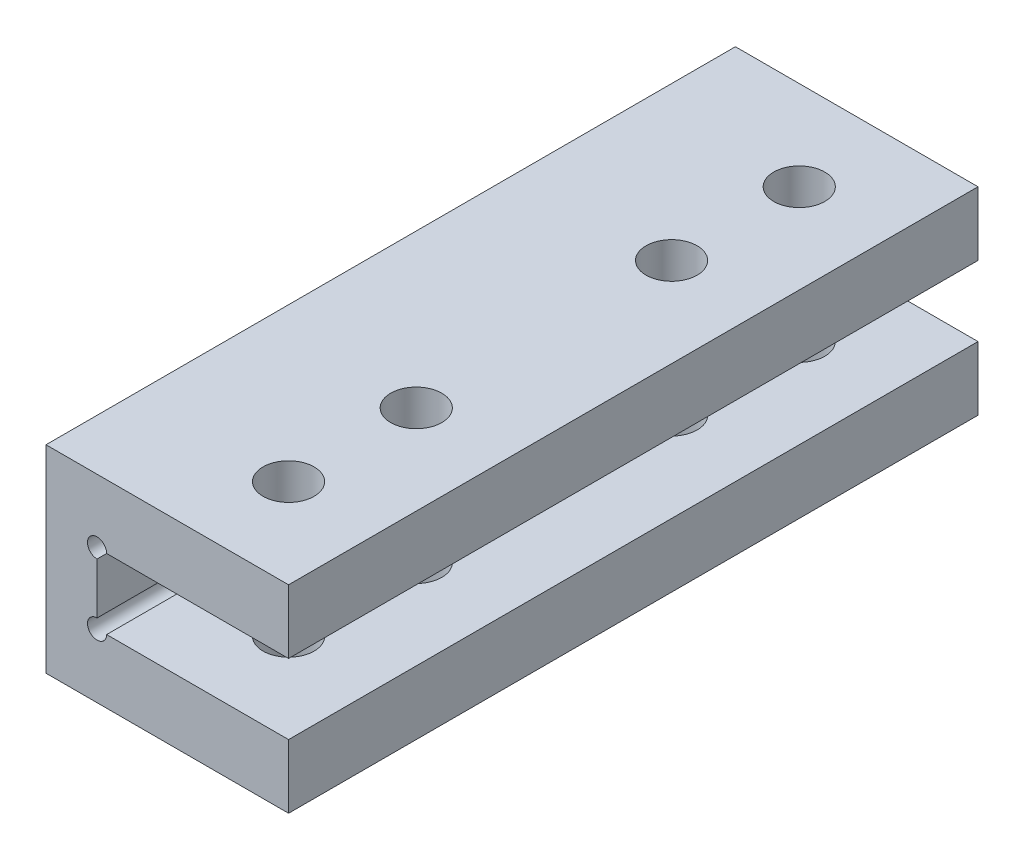
ISO-10303-21;
HEADER;
FILE_DESCRIPTION(('STEP AP214'),'2;1');
FILE_NAME('part.step','',(''),(''),'','','');
FILE_SCHEMA(('AUTOMOTIVE_DESIGN { 1 0 10303 214 1 1 1 1 }'));
ENDSEC;
DATA;
#1=APPLICATION_CONTEXT('core data for automotive mechanical design processes');
#2=APPLICATION_PROTOCOL_DEFINITION('international standard','automotive_design',2000,#1);
#3=PRODUCT_CONTEXT('',#1,'mechanical');
#4=PRODUCT('Part','Part','',(#3));
#5=PRODUCT_RELATED_PRODUCT_CATEGORY('part','',(#4));
#6=PRODUCT_DEFINITION_FORMATION('','',#4);
#7=PRODUCT_DEFINITION_CONTEXT('part definition',#1,'design');
#8=PRODUCT_DEFINITION('design','',#6,#7);
#9=PRODUCT_DEFINITION_SHAPE('','',#8);
#10=(LENGTH_UNIT() NAMED_UNIT(*) SI_UNIT(.MILLI.,.METRE.));
#11=(NAMED_UNIT(*) PLANE_ANGLE_UNIT() SI_UNIT($,.RADIAN.));
#12=(NAMED_UNIT(*) SI_UNIT($,.STERADIAN.) SOLID_ANGLE_UNIT());
#13=UNCERTAINTY_MEASURE_WITH_UNIT(LENGTH_MEASURE(1.E-05),#10,'distance_accuracy_value','');
#14=(GEOMETRIC_REPRESENTATION_CONTEXT(3) GLOBAL_UNCERTAINTY_ASSIGNED_CONTEXT((#13)) GLOBAL_UNIT_ASSIGNED_CONTEXT((#10,
#11,#12)) REPRESENTATION_CONTEXT('',''));
#15=CARTESIAN_POINT('',(0.,0.,0.));
#16=DIRECTION('',(0.,0.,1.));
#17=DIRECTION('',(1.,0.,0.));
#18=AXIS2_PLACEMENT_3D('',#15,#16,#17);
#19=CARTESIAN_POINT('',(0.,5.,0.));
#20=DIRECTION('',(0.,-1.,0.));
#21=DIRECTION('',(0.,0.,-1.));
#22=AXIS2_PLACEMENT_3D('',#19,#20,#21);
#23=PLANE('',#22);
#24=DIRECTION('',(-1.,0.,0.));
#25=VECTOR('',#24,1.);
#26=CARTESIAN_POINT('',(0.,5.,-27.));
#27=LINE('',#26,#25);
#28=CARTESIAN_POINT('',(15.,5.,-27.));
#29=VERTEX_POINT('',#28);
#30=CARTESIAN_POINT('',(-4.,5.,-27.));
#31=VERTEX_POINT('',#30);
#32=EDGE_CURVE('E167',#29,#31,#27,.T.);
#33=ORIENTED_EDGE('',*,*,#32,.T.);
#34=DIRECTION('',(0.,0.,1.));
#35=VECTOR('',#34,1.);
#36=CARTESIAN_POINT('',(-4.,5.,-38.2361025271221));
#37=LINE('',#36,#35);
#38=CARTESIAN_POINT('',(-4.,5.,27.));
#39=VERTEX_POINT('',#38);
#40=EDGE_CURVE('E147',#31,#39,#37,.T.);
#41=ORIENTED_EDGE('',*,*,#40,.T.);
#42=DIRECTION('',(-1.,0.,0.));
#43=VECTOR('',#42,1.);
#44=CARTESIAN_POINT('',(0.,5.,27.));
#45=LINE('',#44,#43);
#46=CARTESIAN_POINT('',(15.,5.,27.));
#47=VERTEX_POINT('',#46);
#48=EDGE_CURVE('E227',#47,#39,#45,.T.);
#49=ORIENTED_EDGE('',*,*,#48,.F.);
#50=DIRECTION('',(0.,0.,-1.));
#51=VECTOR('',#50,1.);
#52=CARTESIAN_POINT('',(15.,5.,0.));
#53=LINE('',#52,#51);
#54=EDGE_CURVE('E165',#47,#29,#53,.T.);
#55=ORIENTED_EDGE('',*,*,#54,.T.);
#56=EDGE_LOOP('',(#33,#41,#49,#55));
#57=FACE_BOUND('',#56,.T.);
#58=CARTESIAN_POINT('',(8.,5.,-10.));
#59=DIRECTION('',(0.,1.,0.));
#60=DIRECTION('',(0.,0.,1.));
#61=AXIS2_PLACEMENT_3D('',#58,#59,#60);
#62=CIRCLE('',#61,2.);
#63=CARTESIAN_POINT('',(8.,5.,-8.));
#64=VERTEX_POINT('',#63);
#65=EDGE_CURVE('E159',#64,#64,#62,.T.);
#66=ORIENTED_EDGE('',*,*,#65,.F.);
#67=EDGE_LOOP('',(#66));
#68=FACE_BOUND('',#67,.T.);
#69=CARTESIAN_POINT('',(8.,5.,-20.));
#70=DIRECTION('',(0.,1.,0.));
#71=DIRECTION('',(0.,0.,1.));
#72=AXIS2_PLACEMENT_3D('',#69,#70,#71);
#73=CIRCLE('',#72,2.);
#74=CARTESIAN_POINT('',(8.,5.,-18.));
#75=VERTEX_POINT('',#74);
#76=EDGE_CURVE('E153',#75,#75,#73,.T.);
#77=ORIENTED_EDGE('',*,*,#76,.F.);
#78=EDGE_LOOP('',(#77));
#79=FACE_BOUND('',#78,.T.);
#80=CARTESIAN_POINT('',(8.,5.,10.));
#81=DIRECTION('',(0.,-1.,0.));
#82=DIRECTION('',(0.,0.,-1.));
#83=AXIS2_PLACEMENT_3D('',#80,#81,#82);
#84=CIRCLE('',#83,2.);
#85=CARTESIAN_POINT('',(8.,5.,8.));
#86=VERTEX_POINT('',#85);
#87=EDGE_CURVE('E222',#86,#86,#84,.T.);
#88=ORIENTED_EDGE('',*,*,#87,.T.);
#89=EDGE_LOOP('',(#88));
#90=FACE_BOUND('',#89,.T.);
#91=CARTESIAN_POINT('',(8.,5.,20.));
#92=DIRECTION('',(0.,-1.,0.));
#93=DIRECTION('',(0.,0.,-1.));
#94=AXIS2_PLACEMENT_3D('',#91,#92,#93);
#95=CIRCLE('',#94,2.);
#96=CARTESIAN_POINT('',(8.,5.,18.));
#97=VERTEX_POINT('',#96);
#98=EDGE_CURVE('E216',#97,#97,#95,.T.);
#99=ORIENTED_EDGE('',*,*,#98,.T.);
#100=EDGE_LOOP('',(#99));
#101=FACE_BOUND('',#100,.T.);
#102=ADVANCED_FACE('F37',(#57,#68,#79,#90,#101),#23,.F.);
#103=CARTESIAN_POINT('',(0.,0.,0.));
#104=DIRECTION('',(0.,-1.,0.));
#105=DIRECTION('',(0.,0.,-1.));
#106=AXIS2_PLACEMENT_3D('',#103,#104,#105);
#107=PLANE('',#106);
#108=DIRECTION('',(0.,0.,1.));
#109=VECTOR('',#108,1.);
#110=CARTESIAN_POINT('',(0.75,0.,-29.1213203435596));
#111=LINE('',#110,#109);
#112=CARTESIAN_POINT('',(0.75,0.,-27.));
#113=VERTEX_POINT('',#112);
#114=CARTESIAN_POINT('',(0.75,0.,27.));
#115=VERTEX_POINT('',#114);
#116=EDGE_CURVE('E59',#113,#115,#111,.T.);
#117=ORIENTED_EDGE('',*,*,#116,.F.);
#118=DIRECTION('',(-1.,0.,0.));
#119=VECTOR('',#118,1.);
#120=CARTESIAN_POINT('',(0.,0.,-27.));
#121=LINE('',#120,#119);
#122=CARTESIAN_POINT('',(15.,0.,-27.));
#123=VERTEX_POINT('',#122);
#124=EDGE_CURVE('E168',#123,#113,#121,.T.);
#125=ORIENTED_EDGE('',*,*,#124,.F.);
#126=DIRECTION('',(0.,0.,-1.));
#127=VECTOR('',#126,1.);
#128=CARTESIAN_POINT('',(15.,0.,0.));
#129=LINE('',#128,#127);
#130=CARTESIAN_POINT('',(15.,0.,27.));
#131=VERTEX_POINT('',#130);
#132=EDGE_CURVE('E162',#131,#123,#129,.T.);
#133=ORIENTED_EDGE('',*,*,#132,.F.);
#134=DIRECTION('',(-1.,0.,0.));
#135=VECTOR('',#134,1.);
#136=CARTESIAN_POINT('',(0.,0.,27.));
#137=LINE('',#136,#135);
#138=EDGE_CURVE('E183',#131,#115,#137,.T.);
#139=ORIENTED_EDGE('',*,*,#138,.T.);
#140=EDGE_LOOP('',(#117,#125,#133,#139));
#141=FACE_BOUND('',#140,.T.);
#142=CARTESIAN_POINT('',(8.,0.,-10.));
#143=DIRECTION('',(0.,1.,0.));
#144=DIRECTION('',(0.,0.,1.));
#145=AXIS2_PLACEMENT_3D('',#142,#143,#144);
#146=CIRCLE('',#145,2.);
#147=CARTESIAN_POINT('',(8.,0.,-8.));
#148=VERTEX_POINT('',#147);
#149=EDGE_CURVE('E156',#148,#148,#146,.T.);
#150=ORIENTED_EDGE('',*,*,#149,.T.);
#151=EDGE_LOOP('',(#150));
#152=FACE_BOUND('',#151,.T.);
#153=CARTESIAN_POINT('',(8.,0.,-20.));
#154=DIRECTION('',(0.,1.,0.));
#155=DIRECTION('',(0.,0.,1.));
#156=AXIS2_PLACEMENT_3D('',#153,#154,#155);
#157=CIRCLE('',#156,2.);
#158=CARTESIAN_POINT('',(8.,0.,-18.));
#159=VERTEX_POINT('',#158);
#160=EDGE_CURVE('E151',#159,#159,#157,.T.);
#161=ORIENTED_EDGE('',*,*,#160,.T.);
#162=EDGE_LOOP('',(#161));
#163=FACE_BOUND('',#162,.T.);
#164=CARTESIAN_POINT('',(8.,0.,10.));
#165=DIRECTION('',(0.,-1.,0.));
#166=DIRECTION('',(0.,0.,-1.));
#167=AXIS2_PLACEMENT_3D('',#164,#165,#166);
#168=CIRCLE('',#167,2.);
#169=CARTESIAN_POINT('',(8.,0.,8.));
#170=VERTEX_POINT('',#169);
#171=EDGE_CURVE('E219',#170,#170,#168,.T.);
#172=ORIENTED_EDGE('',*,*,#171,.F.);
#173=EDGE_LOOP('',(#172));
#174=FACE_BOUND('',#173,.T.);
#175=CARTESIAN_POINT('',(8.,0.,20.));
#176=DIRECTION('',(0.,-1.,0.));
#177=DIRECTION('',(0.,0.,-1.));
#178=AXIS2_PLACEMENT_3D('',#175,#176,#177);
#179=CIRCLE('',#178,2.);
#180=CARTESIAN_POINT('',(8.,0.,18.));
#181=VERTEX_POINT('',#180);
#182=EDGE_CURVE('E215',#181,#181,#179,.T.);
#183=ORIENTED_EDGE('',*,*,#182,.F.);
#184=EDGE_LOOP('',(#183));
#185=FACE_BOUND('',#184,.T.);
#186=ADVANCED_FACE('F178',(#141,#152,#163,#174,#185),#107,.T.);
#187=CARTESIAN_POINT('',(15.,5.,0.));
#188=DIRECTION('',(-1.,0.,0.));
#189=DIRECTION('',(0.,0.,1.));
#190=AXIS2_PLACEMENT_3D('',#187,#188,#189);
#191=PLANE('',#190);
#192=ORIENTED_EDGE('',*,*,#132,.T.);
#193=DIRECTION('',(0.,-1.,0.));
#194=VECTOR('',#193,1.);
#195=CARTESIAN_POINT('',(15.,5.,-27.));
#196=LINE('',#195,#194);
#197=EDGE_CURVE('E45',#29,#123,#196,.T.);
#198=ORIENTED_EDGE('',*,*,#197,.F.);
#199=ORIENTED_EDGE('',*,*,#54,.F.);
#200=DIRECTION('',(0.,-1.,0.));
#201=VECTOR('',#200,1.);
#202=CARTESIAN_POINT('',(15.,5.,27.));
#203=LINE('',#202,#201);
#204=EDGE_CURVE('E230',#47,#131,#203,.T.);
#205=ORIENTED_EDGE('',*,*,#204,.T.);
#206=EDGE_LOOP('',(#192,#198,#199,#205));
#207=FACE_BOUND('',#206,.T.);
#208=ADVANCED_FACE('F39',(#207),#191,.F.);
#209=CARTESIAN_POINT('',(0.,5.,-27.));
#210=DIRECTION('',(0.,0.,1.));
#211=DIRECTION('',(1.,0.,0.));
#212=AXIS2_PLACEMENT_3D('',#209,#210,#211);
#213=PLANE('',#212);
#214=ORIENTED_EDGE('',*,*,#124,.T.);
#215=CARTESIAN_POINT('',(0.,0.,-27.));
#216=DIRECTION('',(0.,0.,1.));
#217=DIRECTION('',(1.,0.,0.));
#218=AXIS2_PLACEMENT_3D('',#215,#216,#217);
#219=CIRCLE('',#218,0.75);
#220=CARTESIAN_POINT('',(0.,-0.75,-27.));
#221=VERTEX_POINT('',#220);
#222=EDGE_CURVE('E119',#221,#113,#219,.F.);
#223=ORIENTED_EDGE('',*,*,#222,.F.);
#224=DIRECTION('',(0.,-1.,0.));
#225=VECTOR('',#224,1.);
#226=CARTESIAN_POINT('',(0.,5.,-27.));
#227=LINE('',#226,#225);
#228=CARTESIAN_POINT('',(0.,-4.75,-27.));
#229=VERTEX_POINT('',#228);
#230=EDGE_CURVE('E130',#221,#229,#227,.T.);
#231=ORIENTED_EDGE('',*,*,#230,.T.);
#232=CARTESIAN_POINT('',(0.,-5.5,-27.));
#233=DIRECTION('',(0.,0.,1.));
#234=DIRECTION('',(1.,0.,0.));
#235=AXIS2_PLACEMENT_3D('',#232,#233,#234);
#236=CIRCLE('',#235,0.75);
#237=CARTESIAN_POINT('',(0.750000000000001,-5.5,-27.));
#238=VERTEX_POINT('',#237);
#239=EDGE_CURVE('E114',#238,#229,#236,.F.);
#240=ORIENTED_EDGE('',*,*,#239,.F.);
#241=DIRECTION('',(-1.,0.,0.));
#242=VECTOR('',#241,1.);
#243=CARTESIAN_POINT('',(0.,-5.5,-27.));
#244=LINE('',#243,#242);
#245=CARTESIAN_POINT('',(15.,-5.49999999999999,-27.));
#246=VERTEX_POINT('',#245);
#247=EDGE_CURVE('E126',#246,#238,#244,.T.);
#248=ORIENTED_EDGE('',*,*,#247,.F.);
#249=DIRECTION('',(0.,1.,0.));
#250=VECTOR('',#249,1.);
#251=CARTESIAN_POINT('',(15.,-10.5,-27.));
#252=LINE('',#251,#250);
#253=CARTESIAN_POINT('',(15.,-10.5,-27.));
#254=VERTEX_POINT('',#253);
#255=EDGE_CURVE('E145',#254,#246,#252,.T.);
#256=ORIENTED_EDGE('',*,*,#255,.F.);
#257=DIRECTION('',(-1.,0.,0.));
#258=VECTOR('',#257,1.);
#259=CARTESIAN_POINT('',(0.,-10.5,-27.));
#260=LINE('',#259,#258);
#261=CARTESIAN_POINT('',(-4.,-10.5,-27.));
#262=VERTEX_POINT('',#261);
#263=EDGE_CURVE('E139',#254,#262,#260,.T.);
#264=ORIENTED_EDGE('',*,*,#263,.T.);
#265=DIRECTION('',(0.,1.,0.));
#266=VECTOR('',#265,1.);
#267=CARTESIAN_POINT('',(-4.,5.,-27.));
#268=LINE('',#267,#266);
#269=EDGE_CURVE('E148',#262,#31,#268,.T.);
#270=ORIENTED_EDGE('',*,*,#269,.T.);
#271=ORIENTED_EDGE('',*,*,#32,.F.);
#272=ORIENTED_EDGE('',*,*,#197,.T.);
#273=EDGE_LOOP('',(#214,#223,#231,#240,#248,#256,#264,#270,#271,#272));
#274=FACE_BOUND('',#273,.T.);
#275=ADVANCED_FACE('F125',(#274),#213,.F.);
#276=CARTESIAN_POINT('',(8.,5.,-10.));
#277=DIRECTION('',(0.,-1.,0.));
#278=DIRECTION('',(0.,0.,-1.));
#279=AXIS2_PLACEMENT_3D('',#276,#277,#278);
#280=CYLINDRICAL_SURFACE('',#279,2.);
#281=ORIENTED_EDGE('',*,*,#65,.T.);
#282=EDGE_LOOP('',(#281));
#283=FACE_BOUND('',#282,.T.);
#284=ORIENTED_EDGE('',*,*,#149,.F.);
#285=EDGE_LOOP('',(#284));
#286=FACE_BOUND('',#285,.T.);
#287=ADVANCED_FACE('F278',(#283,#286),#280,.F.);
#288=CARTESIAN_POINT('',(8.,5.,-20.));
#289=DIRECTION('',(0.,-1.,0.));
#290=DIRECTION('',(0.,0.,-1.));
#291=AXIS2_PLACEMENT_3D('',#288,#289,#290);
#292=CYLINDRICAL_SURFACE('',#291,2.);
#293=ORIENTED_EDGE('',*,*,#76,.T.);
#294=EDGE_LOOP('',(#293));
#295=FACE_BOUND('',#294,.T.);
#296=ORIENTED_EDGE('',*,*,#160,.F.);
#297=EDGE_LOOP('',(#296));
#298=FACE_BOUND('',#297,.T.);
#299=ADVANCED_FACE('F271',(#295,#298),#292,.F.);
#300=CARTESIAN_POINT('',(0.,5.,-38.2361025271221));
#301=DIRECTION('',(1.,0.,0.));
#302=DIRECTION('',(0.,1.,0.));
#303=AXIS2_PLACEMENT_3D('',#300,#301,#302);
#304=PLANE('',#303);
#305=DIRECTION('',(0.,0.,1.));
#306=VECTOR('',#305,1.);
#307=CARTESIAN_POINT('',(0.,-0.75,-29.1213203435596));
#308=LINE('',#307,#306);
#309=CARTESIAN_POINT('',(0.,-0.75,27.));
#310=VERTEX_POINT('',#309);
#311=EDGE_CURVE('E185',#310,#221,#308,.F.);
#312=ORIENTED_EDGE('',*,*,#311,.F.);
#313=DIRECTION('',(0.,-1.,0.));
#314=VECTOR('',#313,1.);
#315=CARTESIAN_POINT('',(0.,5.,27.));
#316=LINE('',#315,#314);
#317=CARTESIAN_POINT('',(0.,-4.75,27.));
#318=VERTEX_POINT('',#317);
#319=EDGE_CURVE('E212',#310,#318,#316,.T.);
#320=ORIENTED_EDGE('',*,*,#319,.T.);
#321=DIRECTION('',(0.,0.,1.));
#322=VECTOR('',#321,1.);
#323=CARTESIAN_POINT('',(0.,-4.75,-29.1213203435596));
#324=LINE('',#323,#322);
#325=EDGE_CURVE('E52',#229,#318,#324,.T.);
#326=ORIENTED_EDGE('',*,*,#325,.F.);
#327=ORIENTED_EDGE('',*,*,#230,.F.);
#328=EDGE_LOOP('',(#312,#320,#326,#327));
#329=FACE_BOUND('',#328,.T.);
#330=ADVANCED_FACE('F269',(#329),#304,.T.);
#331=CARTESIAN_POINT('',(-4.,5.,-38.2361025271221));
#332=DIRECTION('',(-1.,0.,0.));
#333=DIRECTION('',(0.,-1.,0.));
#334=AXIS2_PLACEMENT_3D('',#331,#332,#333);
#335=PLANE('',#334);
#336=ORIENTED_EDGE('',*,*,#40,.F.);
#337=ORIENTED_EDGE('',*,*,#269,.F.);
#338=DIRECTION('',(0.,0.,1.));
#339=VECTOR('',#338,1.);
#340=CARTESIAN_POINT('',(-4.,-10.5,-38.2361025271221));
#341=LINE('',#340,#339);
#342=CARTESIAN_POINT('',(-4.,-10.5,27.));
#343=VERTEX_POINT('',#342);
#344=EDGE_CURVE('E233',#262,#343,#341,.T.);
#345=ORIENTED_EDGE('',*,*,#344,.T.);
#346=DIRECTION('',(0.,1.,0.));
#347=VECTOR('',#346,1.);
#348=CARTESIAN_POINT('',(-4.,5.,27.));
#349=LINE('',#348,#347);
#350=EDGE_CURVE('E209',#343,#39,#349,.T.);
#351=ORIENTED_EDGE('',*,*,#350,.T.);
#352=EDGE_LOOP('',(#336,#337,#345,#351));
#353=FACE_BOUND('',#352,.T.);
#354=ADVANCED_FACE('F256',(#353),#335,.T.);
#355=CARTESIAN_POINT('',(0.,-10.5,0.));
#356=DIRECTION('',(0.,1.,0.));
#357=DIRECTION('',(0.,0.,-1.));
#358=AXIS2_PLACEMENT_3D('',#355,#356,#357);
#359=PLANE('',#358);
#360=ORIENTED_EDGE('',*,*,#263,.F.);
#361=DIRECTION('',(0.,0.,-1.));
#362=VECTOR('',#361,1.);
#363=CARTESIAN_POINT('',(15.,-10.5,0.));
#364=LINE('',#363,#362);
#365=CARTESIAN_POINT('',(15.,-10.5,27.));
#366=VERTEX_POINT('',#365);
#367=EDGE_CURVE('E136',#366,#254,#364,.T.);
#368=ORIENTED_EDGE('',*,*,#367,.F.);
#369=DIRECTION('',(-1.,0.,0.));
#370=VECTOR('',#369,1.);
#371=CARTESIAN_POINT('',(0.,-10.5,27.));
#372=LINE('',#371,#370);
#373=EDGE_CURVE('E202',#366,#343,#372,.T.);
#374=ORIENTED_EDGE('',*,*,#373,.T.);
#375=ORIENTED_EDGE('',*,*,#344,.F.);
#376=EDGE_LOOP('',(#360,#368,#374,#375));
#377=FACE_BOUND('',#376,.T.);
#378=CARTESIAN_POINT('',(8.,-10.5,-10.));
#379=DIRECTION('',(0.,1.,0.));
#380=DIRECTION('',(0.,0.,1.));
#381=AXIS2_PLACEMENT_3D('',#378,#379,#380);
#382=CIRCLE('',#381,2.);
#383=CARTESIAN_POINT('',(8.,-10.5,-8.));
#384=VERTEX_POINT('',#383);
#385=EDGE_CURVE('E141',#384,#384,#382,.T.);
#386=ORIENTED_EDGE('',*,*,#385,.T.);
#387=EDGE_LOOP('',(#386));
#388=FACE_BOUND('',#387,.T.);
#389=CARTESIAN_POINT('',(8.,-10.5,-20.));
#390=DIRECTION('',(0.,1.,0.));
#391=DIRECTION('',(0.,0.,1.));
#392=AXIS2_PLACEMENT_3D('',#389,#390,#391);
#393=CIRCLE('',#392,2.);
#394=CARTESIAN_POINT('',(8.,-10.5,-18.));
#395=VERTEX_POINT('',#394);
#396=EDGE_CURVE('E236',#395,#395,#393,.T.);
#397=ORIENTED_EDGE('',*,*,#396,.T.);
#398=EDGE_LOOP('',(#397));
#399=FACE_BOUND('',#398,.T.);
#400=CARTESIAN_POINT('',(8.,-10.5,10.));
#401=DIRECTION('',(0.,-1.,0.));
#402=DIRECTION('',(0.,0.,-1.));
#403=AXIS2_PLACEMENT_3D('',#400,#401,#402);
#404=CIRCLE('',#403,2.);
#405=CARTESIAN_POINT('',(8.,-10.5,8.));
#406=VERTEX_POINT('',#405);
#407=EDGE_CURVE('E196',#406,#406,#404,.T.);
#408=ORIENTED_EDGE('',*,*,#407,.F.);
#409=EDGE_LOOP('',(#408));
#410=FACE_BOUND('',#409,.T.);
#411=CARTESIAN_POINT('',(8.,-10.5,20.));
#412=DIRECTION('',(0.,-1.,0.));
#413=DIRECTION('',(0.,0.,-1.));
#414=AXIS2_PLACEMENT_3D('',#411,#412,#413);
#415=CIRCLE('',#414,2.);
#416=CARTESIAN_POINT('',(8.,-10.5,18.));
#417=VERTEX_POINT('',#416);
#418=EDGE_CURVE('E188',#417,#417,#415,.T.);
#419=ORIENTED_EDGE('',*,*,#418,.F.);
#420=EDGE_LOOP('',(#419));
#421=FACE_BOUND('',#420,.T.);
#422=ADVANCED_FACE('F249',(#377,#388,#399,#410,#421),#359,.F.);
#423=CARTESIAN_POINT('',(0.,-5.5,0.));
#424=DIRECTION('',(0.,1.,0.));
#425=DIRECTION('',(0.,0.,-1.));
#426=AXIS2_PLACEMENT_3D('',#423,#424,#425);
#427=PLANE('',#426);
#428=DIRECTION('',(0.,0.,1.));
#429=VECTOR('',#428,1.);
#430=CARTESIAN_POINT('',(0.750000000000001,-5.5,-29.1213203435596));
#431=LINE('',#430,#429);
#432=CARTESIAN_POINT('',(0.750000000000001,-5.5,27.));
#433=VERTEX_POINT('',#432);
#434=EDGE_CURVE('E111',#433,#238,#431,.F.);
#435=ORIENTED_EDGE('',*,*,#434,.F.);
#436=DIRECTION('',(-1.,0.,0.));
#437=VECTOR('',#436,1.);
#438=CARTESIAN_POINT('',(0.,-5.5,27.));
#439=LINE('',#438,#437);
#440=CARTESIAN_POINT('',(15.,-5.49999999999999,27.));
#441=VERTEX_POINT('',#440);
#442=EDGE_CURVE('E199',#441,#433,#439,.T.);
#443=ORIENTED_EDGE('',*,*,#442,.F.);
#444=DIRECTION('',(0.,0.,-1.));
#445=VECTOR('',#444,1.);
#446=CARTESIAN_POINT('',(15.,-5.49999999999999,0.));
#447=LINE('',#446,#445);
#448=EDGE_CURVE('E135',#441,#246,#447,.T.);
#449=ORIENTED_EDGE('',*,*,#448,.T.);
#450=ORIENTED_EDGE('',*,*,#247,.T.);
#451=EDGE_LOOP('',(#435,#443,#449,#450));
#452=FACE_BOUND('',#451,.T.);
#453=CARTESIAN_POINT('',(8.,-5.5,-10.));
#454=DIRECTION('',(0.,1.,0.));
#455=DIRECTION('',(0.,0.,1.));
#456=AXIS2_PLACEMENT_3D('',#453,#454,#455);
#457=CIRCLE('',#456,2.);
#458=CARTESIAN_POINT('',(8.,-5.5,-8.));
#459=VERTEX_POINT('',#458);
#460=EDGE_CURVE('E239',#459,#459,#457,.T.);
#461=ORIENTED_EDGE('',*,*,#460,.F.);
#462=EDGE_LOOP('',(#461));
#463=FACE_BOUND('',#462,.T.);
#464=CARTESIAN_POINT('',(8.,-5.5,-20.));
#465=DIRECTION('',(0.,1.,0.));
#466=DIRECTION('',(0.,0.,1.));
#467=AXIS2_PLACEMENT_3D('',#464,#465,#466);
#468=CIRCLE('',#467,2.);
#469=CARTESIAN_POINT('',(8.,-5.5,-18.));
#470=VERTEX_POINT('',#469);
#471=EDGE_CURVE('E235',#470,#470,#468,.T.);
#472=ORIENTED_EDGE('',*,*,#471,.F.);
#473=EDGE_LOOP('',(#472));
#474=FACE_BOUND('',#473,.T.);
#475=CARTESIAN_POINT('',(8.,-5.5,10.));
#476=DIRECTION('',(0.,-1.,0.));
#477=DIRECTION('',(0.,0.,-1.));
#478=AXIS2_PLACEMENT_3D('',#475,#476,#477);
#479=CIRCLE('',#478,2.);
#480=CARTESIAN_POINT('',(8.,-5.5,8.));
#481=VERTEX_POINT('',#480);
#482=EDGE_CURVE('E194',#481,#481,#479,.T.);
#483=ORIENTED_EDGE('',*,*,#482,.T.);
#484=EDGE_LOOP('',(#483));
#485=FACE_BOUND('',#484,.T.);
#486=CARTESIAN_POINT('',(8.,-5.5,20.));
#487=DIRECTION('',(0.,-1.,0.));
#488=DIRECTION('',(0.,0.,-1.));
#489=AXIS2_PLACEMENT_3D('',#486,#487,#488);
#490=CIRCLE('',#489,2.);
#491=CARTESIAN_POINT('',(8.,-5.5,18.));
#492=VERTEX_POINT('',#491);
#493=EDGE_CURVE('E184',#492,#492,#490,.T.);
#494=ORIENTED_EDGE('',*,*,#493,.T.);
#495=EDGE_LOOP('',(#494));
#496=FACE_BOUND('',#495,.T.);
#497=ADVANCED_FACE('F133',(#452,#463,#474,#485,#496),#427,.T.);
#498=CARTESIAN_POINT('',(15.,-10.5,0.));
#499=DIRECTION('',(-1.,0.,0.));
#500=DIRECTION('',(0.,0.,1.));
#501=AXIS2_PLACEMENT_3D('',#498,#499,#500);
#502=PLANE('',#501);
#503=ORIENTED_EDGE('',*,*,#448,.F.);
#504=DIRECTION('',(0.,1.,0.));
#505=VECTOR('',#504,1.);
#506=CARTESIAN_POINT('',(15.,-10.5,27.));
#507=LINE('',#506,#505);
#508=EDGE_CURVE('E205',#366,#441,#507,.T.);
#509=ORIENTED_EDGE('',*,*,#508,.F.);
#510=ORIENTED_EDGE('',*,*,#367,.T.);
#511=ORIENTED_EDGE('',*,*,#255,.T.);
#512=EDGE_LOOP('',(#503,#509,#510,#511));
#513=FACE_BOUND('',#512,.T.);
#514=ADVANCED_FACE('F330',(#513),#502,.F.);
#515=CARTESIAN_POINT('',(8.,-10.5,-10.));
#516=DIRECTION('',(0.,1.,0.));
#517=DIRECTION('',(0.,0.,-1.));
#518=AXIS2_PLACEMENT_3D('',#515,#516,#517);
#519=CYLINDRICAL_SURFACE('',#518,2.);
#520=ORIENTED_EDGE('',*,*,#385,.F.);
#521=EDGE_LOOP('',(#520));
#522=FACE_BOUND('',#521,.T.);
#523=ORIENTED_EDGE('',*,*,#460,.T.);
#524=EDGE_LOOP('',(#523));
#525=FACE_BOUND('',#524,.T.);
#526=ADVANCED_FACE('F426',(#522,#525),#519,.F.);
#527=CARTESIAN_POINT('',(8.,-10.5,-20.));
#528=DIRECTION('',(0.,1.,0.));
#529=DIRECTION('',(0.,0.,-1.));
#530=AXIS2_PLACEMENT_3D('',#527,#528,#529);
#531=CYLINDRICAL_SURFACE('',#530,2.);
#532=ORIENTED_EDGE('',*,*,#396,.F.);
#533=EDGE_LOOP('',(#532));
#534=FACE_BOUND('',#533,.T.);
#535=ORIENTED_EDGE('',*,*,#471,.T.);
#536=EDGE_LOOP('',(#535));
#537=FACE_BOUND('',#536,.T.);
#538=ADVANCED_FACE('F345',(#534,#537),#531,.F.);
#539=CARTESIAN_POINT('',(0.,5.,27.));
#540=DIRECTION('',(0.,0.,-1.));
#541=DIRECTION('',(1.,0.,0.));
#542=AXIS2_PLACEMENT_3D('',#539,#540,#541);
#543=PLANE('',#542);
#544=ORIENTED_EDGE('',*,*,#319,.F.);
#545=CARTESIAN_POINT('',(0.,0.,27.));
#546=DIRECTION('',(0.,0.,1.));
#547=DIRECTION('',(1.,0.,0.));
#548=AXIS2_PLACEMENT_3D('',#545,#546,#547);
#549=CIRCLE('',#548,0.75);
#550=EDGE_CURVE('E131',#115,#310,#549,.T.);
#551=ORIENTED_EDGE('',*,*,#550,.F.);
#552=ORIENTED_EDGE('',*,*,#138,.F.);
#553=ORIENTED_EDGE('',*,*,#204,.F.);
#554=ORIENTED_EDGE('',*,*,#48,.T.);
#555=ORIENTED_EDGE('',*,*,#350,.F.);
#556=ORIENTED_EDGE('',*,*,#373,.F.);
#557=ORIENTED_EDGE('',*,*,#508,.T.);
#558=ORIENTED_EDGE('',*,*,#442,.T.);
#559=CARTESIAN_POINT('',(0.,-5.5,27.));
#560=DIRECTION('',(0.,0.,-1.));
#561=DIRECTION('',(-1.,0.,0.));
#562=AXIS2_PLACEMENT_3D('',#559,#560,#561);
#563=CIRCLE('',#562,0.75);
#564=EDGE_CURVE('E11',#433,#318,#563,.T.);
#565=ORIENTED_EDGE('',*,*,#564,.T.);
#566=EDGE_LOOP('',(#544,#551,#552,#553,#554,#555,#556,#557,#558,#565));
#567=FACE_BOUND('',#566,.T.);
#568=ADVANCED_FACE('F263',(#567),#543,.F.);
#569=CARTESIAN_POINT('',(8.,5.,10.));
#570=DIRECTION('',(0.,-1.,0.));
#571=DIRECTION('',(0.,0.,1.));
#572=AXIS2_PLACEMENT_3D('',#569,#570,#571);
#573=CYLINDRICAL_SURFACE('',#572,2.);
#574=ORIENTED_EDGE('',*,*,#87,.F.);
#575=EDGE_LOOP('',(#574));
#576=FACE_BOUND('',#575,.T.);
#577=ORIENTED_EDGE('',*,*,#171,.T.);
#578=EDGE_LOOP('',(#577));
#579=FACE_BOUND('',#578,.T.);
#580=ADVANCED_FACE('F344',(#576,#579),#573,.F.);
#581=CARTESIAN_POINT('',(8.,5.,20.));
#582=DIRECTION('',(0.,-1.,0.));
#583=DIRECTION('',(0.,0.,1.));
#584=AXIS2_PLACEMENT_3D('',#581,#582,#583);
#585=CYLINDRICAL_SURFACE('',#584,2.);
#586=ORIENTED_EDGE('',*,*,#98,.F.);
#587=EDGE_LOOP('',(#586));
#588=FACE_BOUND('',#587,.T.);
#589=ORIENTED_EDGE('',*,*,#182,.T.);
#590=EDGE_LOOP('',(#589));
#591=FACE_BOUND('',#590,.T.);
#592=ADVANCED_FACE('F385',(#588,#591),#585,.F.);
#593=CARTESIAN_POINT('',(8.,-10.5,10.));
#594=DIRECTION('',(0.,1.,0.));
#595=DIRECTION('',(0.,0.,1.));
#596=AXIS2_PLACEMENT_3D('',#593,#594,#595);
#597=CYLINDRICAL_SURFACE('',#596,2.);
#598=ORIENTED_EDGE('',*,*,#407,.T.);
#599=EDGE_LOOP('',(#598));
#600=FACE_BOUND('',#599,.T.);
#601=ORIENTED_EDGE('',*,*,#482,.F.);
#602=EDGE_LOOP('',(#601));
#603=FACE_BOUND('',#602,.T.);
#604=ADVANCED_FACE('F376',(#600,#603),#597,.F.);
#605=CARTESIAN_POINT('',(8.,-10.5,20.));
#606=DIRECTION('',(0.,1.,0.));
#607=DIRECTION('',(0.,0.,1.));
#608=AXIS2_PLACEMENT_3D('',#605,#606,#607);
#609=CYLINDRICAL_SURFACE('',#608,2.);
#610=ORIENTED_EDGE('',*,*,#418,.T.);
#611=EDGE_LOOP('',(#610));
#612=FACE_BOUND('',#611,.T.);
#613=ORIENTED_EDGE('',*,*,#493,.F.);
#614=EDGE_LOOP('',(#613));
#615=FACE_BOUND('',#614,.T.);
#616=ADVANCED_FACE('F308',(#612,#615),#609,.F.);
#617=CARTESIAN_POINT('',(0.,-5.5,-29.1213203435596));
#618=DIRECTION('',(0.,0.,1.));
#619=DIRECTION('',(1.,0.,0.));
#620=AXIS2_PLACEMENT_3D('',#617,#618,#619);
#621=CYLINDRICAL_SURFACE('',#620,0.75);
#622=ORIENTED_EDGE('',*,*,#325,.T.);
#623=ORIENTED_EDGE('',*,*,#564,.F.);
#624=ORIENTED_EDGE('',*,*,#434,.T.);
#625=ORIENTED_EDGE('',*,*,#239,.T.);
#626=EDGE_LOOP('',(#622,#623,#624,#625));
#627=FACE_BOUND('',#626,.T.);
#628=ADVANCED_FACE('F113',(#627),#621,.F.);
#629=CARTESIAN_POINT('',(0.,0.,-29.1213203435596));
#630=DIRECTION('',(0.,0.,1.));
#631=DIRECTION('',(1.,0.,0.));
#632=AXIS2_PLACEMENT_3D('',#629,#630,#631);
#633=CYLINDRICAL_SURFACE('',#632,0.75);
#634=ORIENTED_EDGE('',*,*,#116,.T.);
#635=ORIENTED_EDGE('',*,*,#550,.T.);
#636=ORIENTED_EDGE('',*,*,#311,.T.);
#637=ORIENTED_EDGE('',*,*,#222,.T.);
#638=EDGE_LOOP('',(#634,#635,#636,#637));
#639=FACE_BOUND('',#638,.T.);
#640=ADVANCED_FACE('F267',(#639),#633,.F.);
#641=CLOSED_SHELL('',(#102,#186,#208,#275,#287,#299,#330,#354,#422,#497,#514,#526,#538,#568,
#580,#592,#604,#616,#628,#640));
#642=MANIFOLD_SOLID_BREP('B2',#641);
#643=ADVANCED_BREP_SHAPE_REPRESENTATION('',(#18,#642),#14);
#644=SHAPE_DEFINITION_REPRESENTATION(#9,#643);
ENDSEC;
END-ISO-10303-21;
